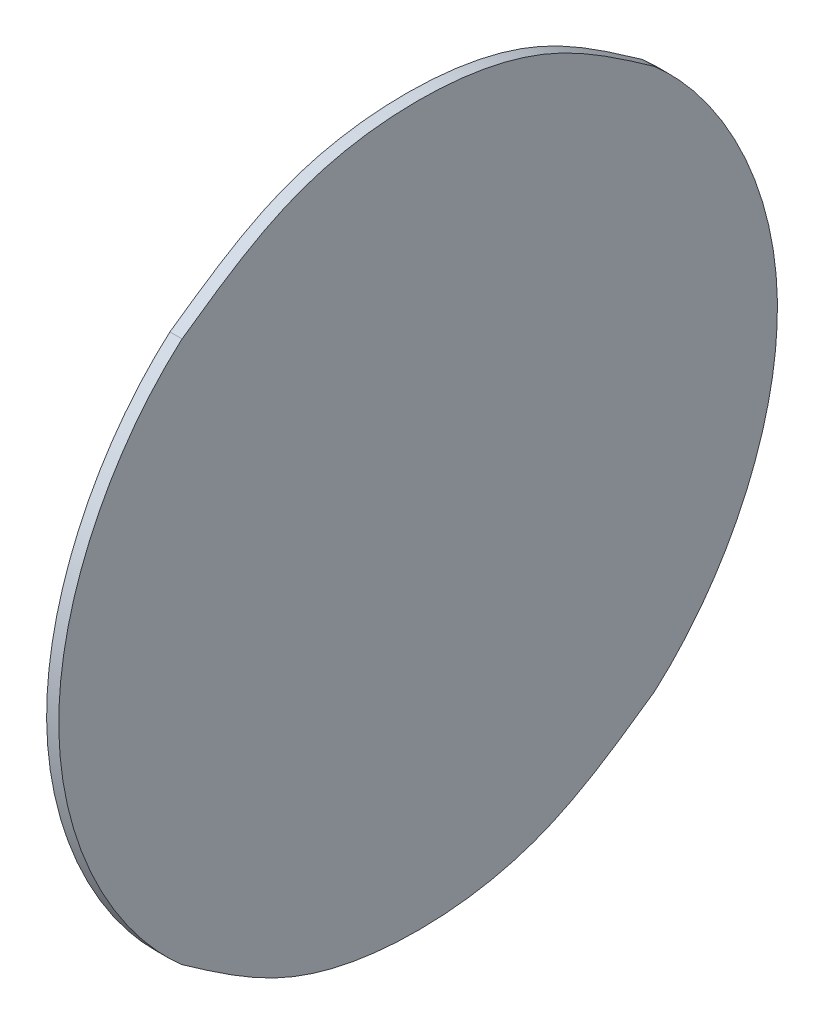
ISO-10303-21;
HEADER;
FILE_DESCRIPTION(('STEP AP214'),'2;1');
FILE_NAME('part.step','',(''),(''),'','','');
FILE_SCHEMA(('AUTOMOTIVE_DESIGN { 1 0 10303 214 1 1 1 1 }'));
ENDSEC;
DATA;
#1=APPLICATION_CONTEXT('core data for automotive mechanical design processes');
#2=APPLICATION_PROTOCOL_DEFINITION('international standard','automotive_design',2000,#1);
#3=PRODUCT_CONTEXT('',#1,'mechanical');
#4=PRODUCT('Part','Part','',(#3));
#5=PRODUCT_RELATED_PRODUCT_CATEGORY('part','',(#4));
#6=PRODUCT_DEFINITION_FORMATION('','',#4);
#7=PRODUCT_DEFINITION_CONTEXT('part definition',#1,'design');
#8=PRODUCT_DEFINITION('design','',#6,#7);
#9=PRODUCT_DEFINITION_SHAPE('','',#8);
#10=(LENGTH_UNIT() NAMED_UNIT(*) SI_UNIT(.MILLI.,.METRE.));
#11=(NAMED_UNIT(*) PLANE_ANGLE_UNIT() SI_UNIT($,.RADIAN.));
#12=(NAMED_UNIT(*) SI_UNIT($,.STERADIAN.) SOLID_ANGLE_UNIT());
#13=UNCERTAINTY_MEASURE_WITH_UNIT(LENGTH_MEASURE(1.E-05),#10,'distance_accuracy_value','');
#14=(GEOMETRIC_REPRESENTATION_CONTEXT(3) GLOBAL_UNCERTAINTY_ASSIGNED_CONTEXT((#13)) GLOBAL_UNIT_ASSIGNED_CONTEXT((#10,
#11,#12)) REPRESENTATION_CONTEXT('',''));
#15=CARTESIAN_POINT('',(0.,0.,0.));
#16=DIRECTION('',(0.,0.,1.));
#17=DIRECTION('',(1.,0.,0.));
#18=AXIS2_PLACEMENT_3D('',#15,#16,#17);
#19=CARTESIAN_POINT('',(24.3378726721836,5.24713751373104,12.853768288365));
#20=CARTESIAN_POINT('',(24.3378726721836,3.89429005793168,10.9294891770502));
#21=CARTESIAN_POINT('',(24.3378726721836,1.1888779964498,7.08133327810403));
#22=CARTESIAN_POINT('',(24.3378726721836,0.0556994271308855,0.00227004264630052));
#23=CARTESIAN_POINT('',(24.3378726721836,1.18760009108754,-7.07864532651337));
#24=CARTESIAN_POINT('',(24.3378726721836,3.89344674910037,-10.9280028546814));
#25=CARTESIAN_POINT('',(24.3378726721836,5.24711899290864,-12.8537470305181));
#26=B_SPLINE_CURVE_WITH_KNOTS('',3,(#19,#20,#21,#22,#23,#24,#25),.UNSPECIFIED.,.F.,.F.,(4,1,1,1,
4),(0.,0.249995452774565,0.499938637096602,0.74983091330815,1.),.UNSPECIFIED.);
#27=DIRECTION('',(1.,0.,0.));
#28=VECTOR('',#27,1.);
#29=SURFACE_OF_LINEAR_EXTRUSION('',#26,#28);
#30=CARTESIAN_POINT('',(24.999,5.24711899290864,-12.8537470305181));
#31=CARTESIAN_POINT('',(24.999,3.89344674910037,-10.9280028546814));
#32=CARTESIAN_POINT('',(24.999,1.18760009108754,-7.07864532651337));
#33=CARTESIAN_POINT('',(24.999,0.0556994271308855,0.00227004264630052));
#34=CARTESIAN_POINT('',(24.999,1.1888779964498,7.08133327810403));
#35=CARTESIAN_POINT('',(24.999,3.89429005793168,10.9294891770502));
#36=CARTESIAN_POINT('',(24.999,5.24713751373104,12.853768288365));
#37=B_SPLINE_CURVE_WITH_KNOTS('',3,(#30,#31,#32,#33,#34,#35,#36),.UNSPECIFIED.,.F.,.F.,(4,1,1,1,
4),(0.,0.25016908669185,0.500061362903398,0.750004547225435,1.),.UNSPECIFIED.);
#38=CARTESIAN_POINT('',(24.999,5.24713751373104,12.853768288365));
#39=VERTEX_POINT('',#38);
#40=CARTESIAN_POINT('',(24.999,5.24711899290864,-12.8537470305181));
#41=VERTEX_POINT('',#40);
#42=EDGE_CURVE('E148',#39,#41,#37,.F.);
#43=ORIENTED_EDGE('',*,*,#42,.F.);
#44=CARTESIAN_POINT('',(24.3378726721836,5.2471375132024,12.8537682888256));
#45=DIRECTION('',(1.,0.,0.));
#46=VECTOR('',#45,1.);
#47=LINE('',#44,#46);
#48=CARTESIAN_POINT('',(24.3378726721836,5.24713751373104,12.853768288365));
#49=VERTEX_POINT('',#48);
#50=EDGE_CURVE('E41',#49,#39,#47,.T.);
#51=ORIENTED_EDGE('',*,*,#50,.F.);
#52=CARTESIAN_POINT('',(24.3378726721836,5.24713751373104,12.853768288365));
#53=CARTESIAN_POINT('',(24.3378726721836,3.89429005793168,10.9294891770502));
#54=CARTESIAN_POINT('',(24.3378726721836,1.1888779964498,7.08133327810403));
#55=CARTESIAN_POINT('',(24.3378726721836,0.0556994271308855,0.00227004264630052));
#56=CARTESIAN_POINT('',(24.3378726721836,1.18760009108754,-7.07864532651337));
#57=CARTESIAN_POINT('',(24.3378726721836,3.89344674910037,-10.9280028546814));
#58=CARTESIAN_POINT('',(24.3378726721836,5.24711899290864,-12.8537470305181));
#59=B_SPLINE_CURVE_WITH_KNOTS('',3,(#52,#53,#54,#55,#56,#57,#58),.UNSPECIFIED.,.F.,.F.,(4,1,1,1,
4),(0.,0.249995452774565,0.499938637096602,0.74983091330815,1.),.UNSPECIFIED.);
#60=CARTESIAN_POINT('',(24.3378726721836,5.24711899290864,-12.8537470305181));
#61=VERTEX_POINT('',#60);
#62=EDGE_CURVE('E97',#49,#61,#59,.T.);
#63=ORIENTED_EDGE('',*,*,#62,.T.);
#64=CARTESIAN_POINT('',(24.3378726721836,5.24711899290864,-12.8537470305181));
#65=DIRECTION('',(1.,0.,0.));
#66=VECTOR('',#65,1.);
#67=LINE('',#64,#66);
#68=EDGE_CURVE('E11',#61,#41,#67,.T.);
#69=ORIENTED_EDGE('',*,*,#68,.T.);
#70=EDGE_LOOP('',(#43,#51,#63,#69));
#71=FACE_BOUND('',#70,.T.);
#72=ADVANCED_FACE('F16',(#71),#29,.T.);
#73=CARTESIAN_POINT('',(24.3378726721836,5.05327570739281,-12.6312797470997));
#74=CARTESIAN_POINT('',(24.3378726721836,5.11789630932934,-12.7054425943417));
#75=CARTESIAN_POINT('',(24.3378726721836,5.18251691126586,-12.7796054415836));
#76=CARTESIAN_POINT('',(24.3378726721836,5.24713751320238,-12.8537682888256));
#77=CARTESIAN_POINT('',(24.3378726721836,8.4781676100285,-16.561910650923));
#78=CARTESIAN_POINT('',(24.3378726721836,14.0618704803,-19.5665402973756));
#79=CARTESIAN_POINT('',(24.3378726721836,25.9375995196999,-19.5665402973756));
#80=CARTESIAN_POINT('',(24.3378726721837,31.5213023899714,-16.561910650923));
#81=CARTESIAN_POINT('',(24.3378726721836,34.7523324867976,-12.8537682888256));
#82=B_SPLINE_CURVE_WITH_KNOTS('',3,(#73,#74,#75,#76,#77,#78,#79,#80,#81),.UNSPECIFIED.,.F.,.F.,
(4,3,2,4),(-0.01,0.,0.5,1.),.UNSPECIFIED.);
#83=DIRECTION('',(1.,0.,0.));
#84=VECTOR('',#83,1.);
#85=SURFACE_OF_LINEAR_EXTRUSION('',#82,#84);
#86=CARTESIAN_POINT('',(24.999,5.24713751320238,-12.8537682888256));
#87=CARTESIAN_POINT('',(24.999,8.4781676100285,-16.561910650923));
#88=CARTESIAN_POINT('',(24.999,14.0618704803,-19.5665402973756));
#89=CARTESIAN_POINT('',(24.999,25.9375995196999,-19.5665402973756));
#90=CARTESIAN_POINT('',(24.999,31.5213023899714,-16.561910650923));
#91=CARTESIAN_POINT('',(24.999,34.7523324867976,-12.8537682888256));
#92=B_SPLINE_CURVE_WITH_KNOTS('',3,(#86,#87,#88,#89,#90,#91),.UNSPECIFIED.,.F.,.F.,(4,2,4),(0.,
0.5,1.),.UNSPECIFIED.);
#93=CARTESIAN_POINT('',(24.999,34.7523324852117,-12.8537682874437));
#94=VERTEX_POINT('',#93);
#95=EDGE_CURVE('E140',#41,#94,#92,.T.);
#96=ORIENTED_EDGE('',*,*,#95,.F.);
#97=ORIENTED_EDGE('',*,*,#68,.F.);
#98=CARTESIAN_POINT('',(24.3378726721836,34.7523324852117,-12.8537682874437));
#99=VERTEX_POINT('',#98);
#100=EDGE_CURVE('E92',#61,#99,#82,.T.);
#101=ORIENTED_EDGE('',*,*,#100,.T.);
#102=CARTESIAN_POINT('',(24.3378726721836,34.7523324867976,-12.8537682888256));
#103=DIRECTION('',(1.,0.,0.));
#104=VECTOR('',#103,1.);
#105=LINE('',#102,#104);
#106=EDGE_CURVE('E29',#99,#94,#105,.T.);
#107=ORIENTED_EDGE('',*,*,#106,.T.);
#108=EDGE_LOOP('',(#96,#97,#101,#107));
#109=FACE_BOUND('',#108,.T.);
#110=ADVANCED_FACE('F93',(#109),#85,.T.);
#111=CARTESIAN_POINT('',(24.3378726721836,34.7523324852117,-12.8537682874437));
#112=CARTESIAN_POINT('',(24.3378726721836,36.1051869058398,-10.929476849143));
#113=CARTESIAN_POINT('',(24.3378726721836,38.8106085504197,-7.08130247924903));
#114=CARTESIAN_POINT('',(24.3378726721836,39.9437679331353,-0.0022354973574926));
#115=CARTESIAN_POINT('',(24.3378726721836,38.8118591373334,7.07866048398586));
#116=CARTESIAN_POINT('',(24.3378726721836,36.1060239498811,10.9280018064825));
#117=CARTESIAN_POINT('',(24.3378726721836,34.7523510081487,12.8537470314393));
#118=B_SPLINE_CURVE_WITH_KNOTS('',3,(#111,#112,#113,#114,#115,#116,#117),.UNSPECIFIED.,.F.,.F.,
(4,1,1,1,4),(0.,0.249996918098576,0.499940764497156,0.749830788104665,1.),.UNSPECIFIED.);
#119=DIRECTION('',(1.,0.,0.));
#120=VECTOR('',#119,1.);
#121=SURFACE_OF_LINEAR_EXTRUSION('',#118,#120);
#122=CARTESIAN_POINT('',(24.999,34.7523510081487,12.8537470314393));
#123=CARTESIAN_POINT('',(24.999,36.1060239498811,10.9280018064825));
#124=CARTESIAN_POINT('',(24.999,38.8118591373334,7.07866048398586));
#125=CARTESIAN_POINT('',(24.999,39.9437679331353,-0.0022354973574926));
#126=CARTESIAN_POINT('',(24.999,38.8106085504197,-7.08130247924903));
#127=CARTESIAN_POINT('',(24.999,36.1051869058398,-10.929476849143));
#128=CARTESIAN_POINT('',(24.999,34.7523324852117,-12.8537682874437));
#129=B_SPLINE_CURVE_WITH_KNOTS('',3,(#122,#123,#124,#125,#126,#127,#128),.UNSPECIFIED.,.F.,.F.,
(4,1,1,1,4),(0.,0.250169211895335,0.500059235502844,0.750003081901424,1.),.UNSPECIFIED.);
#130=CARTESIAN_POINT('',(24.999,34.7523510081487,12.8537470314393));
#131=VERTEX_POINT('',#130);
#132=EDGE_CURVE('E85',#94,#131,#129,.F.);
#133=ORIENTED_EDGE('',*,*,#132,.F.);
#134=ORIENTED_EDGE('',*,*,#106,.F.);
#135=CARTESIAN_POINT('',(24.3378726721836,34.7523324852117,-12.8537682874437));
#136=CARTESIAN_POINT('',(24.3378726721836,36.1051869058398,-10.929476849143));
#137=CARTESIAN_POINT('',(24.3378726721836,38.8106085504197,-7.08130247924903));
#138=CARTESIAN_POINT('',(24.3378726721836,39.9437679331353,-0.0022354973574926));
#139=CARTESIAN_POINT('',(24.3378726721836,38.8118591373334,7.07866048398586));
#140=CARTESIAN_POINT('',(24.3378726721836,36.1060239498811,10.9280018064825));
#141=CARTESIAN_POINT('',(24.3378726721836,34.7523510081487,12.8537470314393));
#142=B_SPLINE_CURVE_WITH_KNOTS('',3,(#135,#136,#137,#138,#139,#140,#141),.UNSPECIFIED.,.F.,.F.,
(4,1,1,1,4),(0.,0.249996918098576,0.499940764497156,0.749830788104665,1.),.UNSPECIFIED.);
#143=CARTESIAN_POINT('',(24.3378726721836,34.7523510081487,12.8537470314393));
#144=VERTEX_POINT('',#143);
#145=EDGE_CURVE('E81',#99,#144,#142,.T.);
#146=ORIENTED_EDGE('',*,*,#145,.T.);
#147=CARTESIAN_POINT('',(24.3378726721836,34.7523510081487,12.8537470314393));
#148=DIRECTION('',(1.,0.,0.));
#149=VECTOR('',#148,1.);
#150=LINE('',#147,#149);
#151=EDGE_CURVE('E61',#144,#131,#150,.T.);
#152=ORIENTED_EDGE('',*,*,#151,.T.);
#153=EDGE_LOOP('',(#133,#134,#146,#152));
#154=FACE_BOUND('',#153,.T.);
#155=ADVANCED_FACE('F79',(#154),#121,.T.);
#156=CARTESIAN_POINT('',(24.3378726721836,34.9461942926072,12.6312797470997));
#157=CARTESIAN_POINT('',(24.3378726721836,34.8815736906706,12.7054425943417));
#158=CARTESIAN_POINT('',(24.3378726721836,34.8169530887341,12.7796054415836));
#159=CARTESIAN_POINT('',(24.3378726721836,34.7523324867976,12.8537682888256));
#160=CARTESIAN_POINT('',(24.3378726721836,31.5213023899715,16.561910650923));
#161=CARTESIAN_POINT('',(24.3378726721836,25.9375995196999,19.5665402973756));
#162=CARTESIAN_POINT('',(24.3378726721836,14.0618704803001,19.5665402973756));
#163=CARTESIAN_POINT('',(24.3378726721836,8.47816761002851,16.561910650923));
#164=CARTESIAN_POINT('',(24.3378726721836,5.2471375132024,12.8537682888256));
#165=B_SPLINE_CURVE_WITH_KNOTS('',3,(#156,#157,#158,#159,#160,#161,#162,#163,#164),
.UNSPECIFIED.,.F.,.F.,(4,3,2,4),(-0.01,0.,0.5,1.),.UNSPECIFIED.);
#166=DIRECTION('',(1.,0.,0.));
#167=VECTOR('',#166,1.);
#168=SURFACE_OF_LINEAR_EXTRUSION('',#165,#167);
#169=CARTESIAN_POINT('',(24.999,34.7523324867976,12.8537682888256));
#170=CARTESIAN_POINT('',(24.999,31.5213023899715,16.561910650923));
#171=CARTESIAN_POINT('',(24.999,25.9375995196999,19.5665402973756));
#172=CARTESIAN_POINT('',(24.999,14.0618704803001,19.5665402973756));
#173=CARTESIAN_POINT('',(24.999,8.47816761002851,16.561910650923));
#174=CARTESIAN_POINT('',(24.999,5.2471375132024,12.8537682888256));
#175=B_SPLINE_CURVE_WITH_KNOTS('',3,(#169,#170,#171,#172,#173,#174),.UNSPECIFIED.,.F.,.F.,(4,2,
4),(0.,0.5,1.),.UNSPECIFIED.);
#176=EDGE_CURVE('E153',#131,#39,#175,.T.);
#177=ORIENTED_EDGE('',*,*,#176,.F.);
#178=ORIENTED_EDGE('',*,*,#151,.F.);
#179=EDGE_CURVE('E101',#144,#49,#165,.T.);
#180=ORIENTED_EDGE('',*,*,#179,.T.);
#181=ORIENTED_EDGE('',*,*,#50,.T.);
#182=EDGE_LOOP('',(#177,#178,#180,#181));
#183=FACE_BOUND('',#182,.T.);
#184=ADVANCED_FACE('F121',(#183),#168,.T.);
#185=CARTESIAN_POINT('',(24.3378726721836,38.7605359730097,-3.00738998868599));
#186=DIRECTION('',(1.,0.,0.));
#187=DIRECTION('',(0.,1.,0.));
#188=AXIS2_PLACEMENT_3D('',#185,#186,#187);
#189=PLANE('',#188);
#190=ORIENTED_EDGE('',*,*,#62,.F.);
#191=ORIENTED_EDGE('',*,*,#179,.F.);
#192=ORIENTED_EDGE('',*,*,#145,.F.);
#193=ORIENTED_EDGE('',*,*,#100,.F.);
#194=EDGE_LOOP('',(#190,#191,#192,#193));
#195=FACE_BOUND('',#194,.T.);
#196=ADVANCED_FACE('F100',(#195),#189,.F.);
#197=CARTESIAN_POINT('',(24.999,38.7605359730097,-3.00738998868599));
#198=DIRECTION('',(1.,0.,0.));
#199=DIRECTION('',(0.,1.,0.));
#200=AXIS2_PLACEMENT_3D('',#197,#198,#199);
#201=PLANE('',#200);
#202=ORIENTED_EDGE('',*,*,#42,.T.);
#203=ORIENTED_EDGE('',*,*,#95,.T.);
#204=ORIENTED_EDGE('',*,*,#132,.T.);
#205=ORIENTED_EDGE('',*,*,#176,.T.);
#206=EDGE_LOOP('',(#202,#203,#204,#205));
#207=FACE_BOUND('',#206,.T.);
#208=ADVANCED_FACE('F120',(#207),#201,.T.);
#209=CLOSED_SHELL('',(#72,#110,#155,#184,#196,#208));
#210=MANIFOLD_SOLID_BREP('B1',#209);
#211=ADVANCED_BREP_SHAPE_REPRESENTATION('',(#18,#210),#14);
#212=SHAPE_DEFINITION_REPRESENTATION(#9,#211);
ENDSEC;
END-ISO-10303-21;
